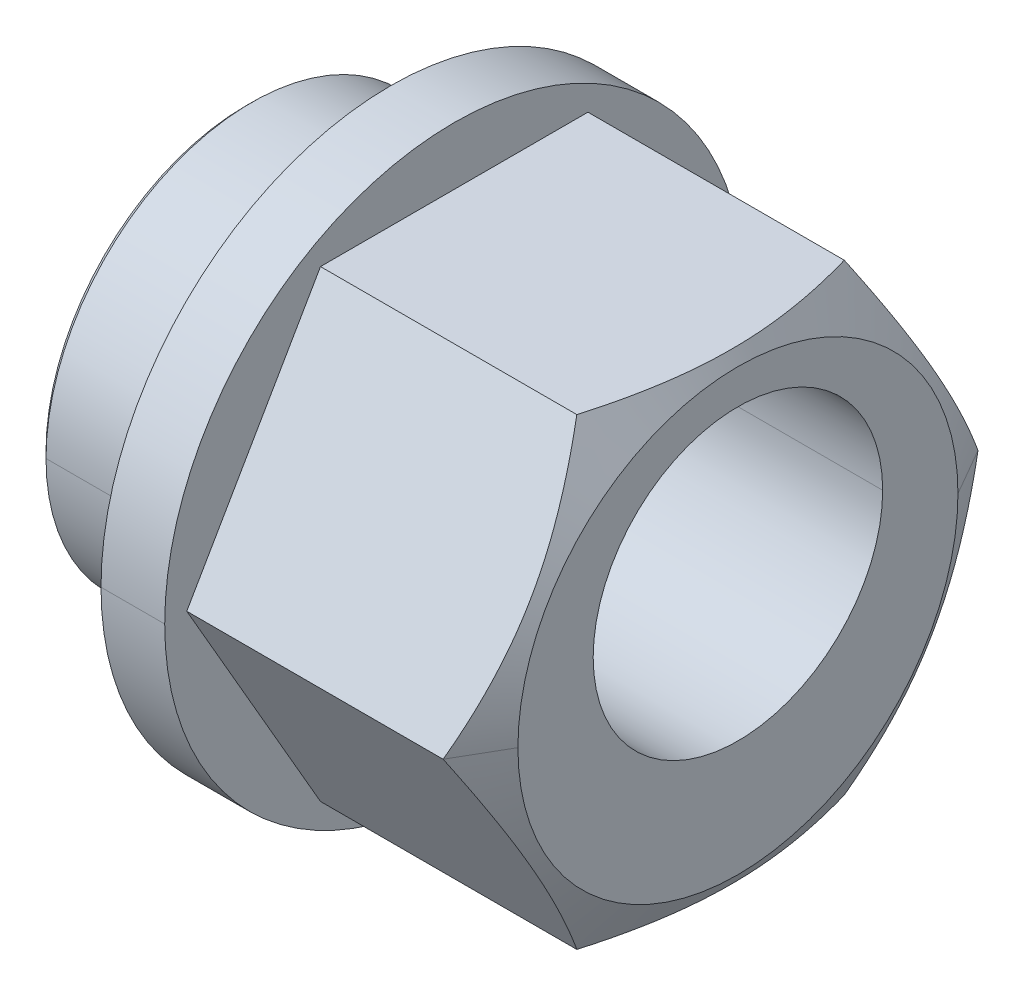
ISO-10303-21;
HEADER;
FILE_DESCRIPTION(('STEP AP214'),'2;1');
FILE_NAME('part.step','',(''),(''),'','','');
FILE_SCHEMA(('AUTOMOTIVE_DESIGN { 1 0 10303 214 1 1 1 1 }'));
ENDSEC;
DATA;
#1=APPLICATION_CONTEXT('core data for automotive mechanical design processes');
#2=APPLICATION_PROTOCOL_DEFINITION('international standard','automotive_design',2000,#1);
#3=PRODUCT_CONTEXT('',#1,'mechanical');
#4=PRODUCT('Part','Part','',(#3));
#5=PRODUCT_RELATED_PRODUCT_CATEGORY('part','',(#4));
#6=PRODUCT_DEFINITION_FORMATION('','',#4);
#7=PRODUCT_DEFINITION_CONTEXT('part definition',#1,'design');
#8=PRODUCT_DEFINITION('design','',#6,#7);
#9=PRODUCT_DEFINITION_SHAPE('','',#8);
#10=(LENGTH_UNIT() NAMED_UNIT(*) SI_UNIT(.MILLI.,.METRE.));
#11=(NAMED_UNIT(*) PLANE_ANGLE_UNIT() SI_UNIT($,.RADIAN.));
#12=(NAMED_UNIT(*) SI_UNIT($,.STERADIAN.) SOLID_ANGLE_UNIT());
#13=UNCERTAINTY_MEASURE_WITH_UNIT(LENGTH_MEASURE(1.E-05),#10,'distance_accuracy_value','');
#14=(GEOMETRIC_REPRESENTATION_CONTEXT(3) GLOBAL_UNCERTAINTY_ASSIGNED_CONTEXT((#13)) GLOBAL_UNIT_ASSIGNED_CONTEXT((#10,
#11,#12)) REPRESENTATION_CONTEXT('',''));
#15=CARTESIAN_POINT('',(0.,0.,0.));
#16=DIRECTION('',(0.,0.,1.));
#17=DIRECTION('',(1.,0.,0.));
#18=AXIS2_PLACEMENT_3D('',#15,#16,#17);
#19=CARTESIAN_POINT('',(0.,0.,0.));
#20=DIRECTION('',(-1.,0.,0.));
#21=DIRECTION('',(0.,0.,1.));
#22=AXIS2_PLACEMENT_3D('',#19,#20,#21);
#23=CYLINDRICAL_SURFACE('',#22,5.);
#24=DIRECTION('',(-1.,0.,0.));
#25=VECTOR('',#24,1.);
#26=CARTESIAN_POINT('',(0.,0.,-5.));
#27=LINE('',#26,#25);
#28=CARTESIAN_POINT('',(-0.65,0.,-5.));
#29=VERTEX_POINT('',#28);
#30=CARTESIAN_POINT('',(-1.75,0.,-5.));
#31=VERTEX_POINT('',#30);
#32=EDGE_CURVE('E441',#29,#31,#27,.T.);
#33=ORIENTED_EDGE('',*,*,#32,.F.);
#34=CARTESIAN_POINT('',(-0.65,0.,0.));
#35=DIRECTION('',(1.,0.,0.));
#36=DIRECTION('',(0.,0.,1.));
#37=AXIS2_PLACEMENT_3D('',#34,#35,#36);
#38=CIRCLE('',#37,5.);
#39=CARTESIAN_POINT('',(-0.65,0.,5.));
#40=VERTEX_POINT('',#39);
#41=EDGE_CURVE('E11',#40,#29,#38,.T.);
#42=ORIENTED_EDGE('',*,*,#41,.F.);
#43=DIRECTION('',(-1.,0.,0.));
#44=VECTOR('',#43,1.);
#45=CARTESIAN_POINT('',(0.,0.,5.));
#46=LINE('',#45,#44);
#47=CARTESIAN_POINT('',(-1.75,0.,5.));
#48=VERTEX_POINT('',#47);
#49=EDGE_CURVE('E417',#40,#48,#46,.T.);
#50=ORIENTED_EDGE('',*,*,#49,.T.);
#51=CARTESIAN_POINT('',(-1.75,0.,0.));
#52=DIRECTION('',(1.,0.,0.));
#53=DIRECTION('',(0.,0.,1.));
#54=AXIS2_PLACEMENT_3D('',#51,#52,#53);
#55=CIRCLE('',#54,5.);
#56=EDGE_CURVE('E30',#48,#31,#55,.T.);
#57=ORIENTED_EDGE('',*,*,#56,.T.);
#58=EDGE_LOOP('',(#33,#42,#50,#57));
#59=FACE_BOUND('',#58,.T.);
#60=ADVANCED_FACE('F17',(#59),#23,.T.);
#61=CARTESIAN_POINT('',(-0.65,5.,0.));
#62=DIRECTION('',(1.,0.,0.));
#63=DIRECTION('',(0.,1.,0.));
#64=AXIS2_PLACEMENT_3D('',#61,#62,#63);
#65=PLANE('',#64);
#66=DIRECTION('',(0.,0.866025403784439,-0.5));
#67=VECTOR('',#66,1.);
#68=CARTESIAN_POINT('',(-0.65,-4.,-2.30940107675851));
#69=LINE('',#68,#67);
#70=CARTESIAN_POINT('',(-0.65,-4.,-2.30940107675851));
#71=VERTEX_POINT('',#70);
#72=CARTESIAN_POINT('',(-0.65,3.4530903348682E-12,-4.61880215351501));
#73=VERTEX_POINT('',#72);
#74=EDGE_CURVE('E44',#71,#73,#69,.T.);
#75=ORIENTED_EDGE('',*,*,#74,.F.);
#76=DIRECTION('',(0.,0.,-1.));
#77=VECTOR('',#76,1.);
#78=CARTESIAN_POINT('',(-0.65,-4.,2.30940107675851));
#79=LINE('',#78,#77);
#80=CARTESIAN_POINT('',(-0.65,-3.99999999687367,2.3094010930034));
#81=VERTEX_POINT('',#80);
#82=EDGE_CURVE('E154',#81,#71,#79,.T.);
#83=ORIENTED_EDGE('',*,*,#82,.F.);
#84=DIRECTION('',(0.,-0.866025403784439,-0.5));
#85=VECTOR('',#84,1.);
#86=CARTESIAN_POINT('',(-0.65,0.,4.61880215351701));
#87=LINE('',#86,#85);
#88=CARTESIAN_POINT('',(-0.65,1.48208150438996E-11,4.61880215352214));
#89=VERTEX_POINT('',#88);
#90=EDGE_CURVE('E151',#89,#81,#87,.T.);
#91=ORIENTED_EDGE('',*,*,#90,.F.);
#92=DIRECTION('',(0.,-0.866025403784439,0.5));
#93=VECTOR('',#92,1.);
#94=CARTESIAN_POINT('',(-0.65,4.,2.30940107675851));
#95=LINE('',#94,#93);
#96=CARTESIAN_POINT('',(-0.65,4.00000001250421,2.30940106592954));
#97=VERTEX_POINT('',#96);
#98=EDGE_CURVE('E137',#97,#89,#95,.T.);
#99=ORIENTED_EDGE('',*,*,#98,.F.);
#100=DIRECTION('',(0.,0.,1.));
#101=VECTOR('',#100,1.);
#102=CARTESIAN_POINT('',(-0.65,4.,-2.3094010767585));
#103=LINE('',#102,#101);
#104=CARTESIAN_POINT('',(-0.65,3.99999999687402,-2.30940109300157));
#105=VERTEX_POINT('',#104);
#106=EDGE_CURVE('E449',#105,#97,#103,.T.);
#107=ORIENTED_EDGE('',*,*,#106,.F.);
#108=DIRECTION('',(0.,0.866025403784439,0.5));
#109=VECTOR('',#108,1.);
#110=CARTESIAN_POINT('',(-0.65,0.,-4.61880215351701));
#111=LINE('',#110,#109);
#112=EDGE_CURVE('E626',#73,#105,#111,.T.);
#113=ORIENTED_EDGE('',*,*,#112,.F.);
#114=EDGE_LOOP('',(#75,#83,#91,#99,#107,#113));
#115=FACE_BOUND('',#114,.T.);
#116=ORIENTED_EDGE('',*,*,#41,.T.);
#117=CARTESIAN_POINT('',(-0.65,0.,0.));
#118=DIRECTION('',(1.,0.,0.));
#119=DIRECTION('',(0.,0.,1.));
#120=AXIS2_PLACEMENT_3D('',#117,#118,#119);
#121=CIRCLE('',#120,5.);
#122=EDGE_CURVE('E457',#29,#40,#121,.T.);
#123=ORIENTED_EDGE('',*,*,#122,.T.);
#124=EDGE_LOOP('',(#116,#123));
#125=FACE_BOUND('',#124,.T.);
#126=ADVANCED_FACE('F19',(#115,#125),#65,.T.);
#127=CARTESIAN_POINT('',(-1.75,5.,0.));
#128=DIRECTION('',(1.,0.,0.));
#129=DIRECTION('',(0.,1.,0.));
#130=AXIS2_PLACEMENT_3D('',#127,#128,#129);
#131=PLANE('',#130);
#132=CARTESIAN_POINT('',(-1.75,0.,0.));
#133=DIRECTION('',(-1.,0.,0.));
#134=DIRECTION('',(0.,0.,1.));
#135=AXIS2_PLACEMENT_3D('',#132,#133,#134);
#136=CIRCLE('',#135,3.55);
#137=CARTESIAN_POINT('',(-1.75,0.,3.55));
#138=VERTEX_POINT('',#137);
#139=CARTESIAN_POINT('',(-1.75,0.,-3.55));
#140=VERTEX_POINT('',#139);
#141=EDGE_CURVE('E182',#138,#140,#136,.T.);
#142=ORIENTED_EDGE('',*,*,#141,.F.);
#143=CARTESIAN_POINT('',(-1.75,0.,0.));
#144=DIRECTION('',(-1.,0.,0.));
#145=DIRECTION('',(0.,0.,1.));
#146=AXIS2_PLACEMENT_3D('',#143,#144,#145);
#147=CIRCLE('',#146,3.55);
#148=EDGE_CURVE('E356',#140,#138,#147,.T.);
#149=ORIENTED_EDGE('',*,*,#148,.F.);
#150=EDGE_LOOP('',(#142,#149));
#151=FACE_BOUND('',#150,.T.);
#152=ORIENTED_EDGE('',*,*,#56,.F.);
#153=CARTESIAN_POINT('',(-1.75,0.,0.));
#154=DIRECTION('',(1.,0.,0.));
#155=DIRECTION('',(0.,0.,1.));
#156=AXIS2_PLACEMENT_3D('',#153,#154,#155);
#157=CIRCLE('',#156,5.);
#158=EDGE_CURVE('E432',#31,#48,#157,.T.);
#159=ORIENTED_EDGE('',*,*,#158,.F.);
#160=EDGE_LOOP('',(#152,#159));
#161=FACE_BOUND('',#160,.T.);
#162=ADVANCED_FACE('F857',(#151,#161),#131,.F.);
#163=CARTESIAN_POINT('',(-16.0335569799682,-4.,-2.30940107675851));
#164=DIRECTION('',(0.,-0.5,-0.866025403784439));
#165=DIRECTION('',(0.,-0.866025403784439,0.5));
#166=AXIS2_PLACEMENT_3D('',#163,#164,#165);
#167=PLANE('',#166);
#168=CARTESIAN_POINT('',(3.77726437412585,-4.,-2.30940101478377));
#169=CARTESIAN_POINT('',(3.80519870993255,-3.9161956272692,-2.35777895486919));
#170=CARTESIAN_POINT('',(3.83192511441484,-3.83208031891841,-2.4063355972529));
#171=CARTESIAN_POINT('',(3.88200284529315,-3.66531270844499,-2.50262393731974));
#172=CARTESIAN_POINT('',(3.90542092931195,-3.58267519575891,-2.5503466164956));
#173=CARTESIAN_POINT('',(3.94889246948545,-3.41846644993615,-2.6452144453723));
#174=CARTESIAN_POINT('',(3.96900317253339,-3.33690632860232,-2.69235242391481));
#175=CARTESIAN_POINT('',(4.00585775589339,-3.17439569050828,-2.78630503323489));
#176=CARTESIAN_POINT('',(4.02264419975537,-3.09345225345188,-2.83311517311735));
#177=CARTESIAN_POINT('',(4.05369004298886,-2.9274371069949,-2.92894233584061));
#178=CARTESIAN_POINT('',(4.06780442846447,-2.84234145882126,-2.97796519986655));
#179=CARTESIAN_POINT('',(4.09195134676672,-2.67334804024088,-3.07530990605876));
#180=CARTESIAN_POINT('',(4.10205627283969,-2.58945819144323,-3.12362739221196));
#181=CARTESIAN_POINT('',(4.11820481999194,-2.42214689849685,-3.22013419429681));
#182=CARTESIAN_POINT('',(4.1242815167232,-2.33872736072518,-3.26832123454136));
#183=CARTESIAN_POINT('',(4.13241719152581,-2.1714958813286,-3.36499678783931));
#184=CARTESIAN_POINT('',(4.13446270504651,-2.08768355876174,-3.41348577036787));
#185=CARTESIAN_POINT('',(4.13459480422926,-1.91941513164432,-3.51061897499976));
#186=CARTESIAN_POINT('',(4.13265544463653,-1.83495839773552,-3.55926214245593));
#187=CARTESIAN_POINT('',(4.1246943056867,-1.66657827538702,-3.65628866544214));
#188=CARTESIAN_POINT('',(4.11869036245238,-1.58265416704515,-3.70467222906877));
#189=CARTESIAN_POINT('',(4.10264374793344,-1.4145330496652,-3.80174624105042));
#190=CARTESIAN_POINT('',(4.09257129112916,-1.33033867300252,-3.85043628711587));
#191=CARTESIAN_POINT('',(4.0684480518484,-1.16080155347877,-3.94849629272073));
#192=CARTESIAN_POINT('',(4.05432689257414,-1.07546650449104,-3.99786209627561));
#193=CARTESIAN_POINT('',(4.0232588570068,-0.909036172948516,-4.09398819739629));
#194=CARTESIAN_POINT('',(4.00646670334998,-0.827922044044928,-4.14076623621978));
#195=CARTESIAN_POINT('',(3.96957240607652,-0.665043418587901,-4.23473790022201));
#196=CARTESIAN_POINT('',(3.94942531823478,-0.583286837926325,-4.28192755483478));
#197=CARTESIAN_POINT('',(3.90585218775637,-0.418652936324035,-4.37698932609435));
#198=CARTESIAN_POINT('',(3.8823664561961,-0.335787865594583,-4.42485511485887));
#199=CARTESIAN_POINT('',(3.83212430476964,-0.16850389833451,-4.521485229851));
#200=CARTESIAN_POINT('',(3.8052987866747,-0.0841005341154185,-4.57024060985095));
#201=CARTESIAN_POINT('',(3.77726436873621,-3.74976157548811E-08,-4.61880213186476));
#202=B_SPLINE_CURVE_WITH_KNOTS('',3,(#168,#169,#170,#171,#172,#173,#174,#175,#176,#177,#178,
#179,#180,#181,#182,#183,#184,#185,#186,#187,#188,#189,#190,#191,#192,#193,#194,#195,#196,#197,
#198,#199,#200,#201),.UNSPECIFIED.,.F.,.F.,(4,2,2,2,2,2,2,2,2,2,2,2,2,2,2,2,4),(0.,
0.30215722779744,0.596895393122196,0.885820933170358,1.17076636107292,1.46834357250639,
1.76027241140297,2.04977352099937,2.34023996502845,2.63260360921043,2.9236925545966,
3.21695234078176,3.51565574203644,3.8009926557766,4.09051551200188,4.38608455116355,
4.68932925761285),.UNSPECIFIED.);
#203=CARTESIAN_POINT('',(3.77726437412585,-4.,-2.30940101478376));
#204=VERTEX_POINT('',#203);
#205=CARTESIAN_POINT('',(3.77726436873622,-3.74976083109087E-08,-4.61880213186476));
#206=VERTEX_POINT('',#205);
#207=EDGE_CURVE('E351',#204,#206,#202,.T.);
#208=ORIENTED_EDGE('',*,*,#207,.F.);
#209=DIRECTION('',(1.,0.,0.));
#210=VECTOR('',#209,1.);
#211=CARTESIAN_POINT('',(-16.0335569799682,-4.,-2.30940107675851));
#212=LINE('',#211,#210);
#213=EDGE_CURVE('E165',#71,#204,#212,.T.);
#214=ORIENTED_EDGE('',*,*,#213,.F.);
#215=ORIENTED_EDGE('',*,*,#74,.T.);
#216=DIRECTION('',(-1.,0.,0.));
#217=VECTOR('',#216,1.);
#218=CARTESIAN_POINT('',(-16.0335569799682,5.18045986577504E-12,-4.61880215351402));
#219=LINE('',#218,#217);
#220=EDGE_CURVE('E557',#206,#73,#219,.T.);
#221=ORIENTED_EDGE('',*,*,#220,.F.);
#222=EDGE_LOOP('',(#208,#214,#215,#221));
#223=FACE_BOUND('',#222,.T.);
#224=ADVANCED_FACE('F853',(#223),#167,.T.);
#225=CARTESIAN_POINT('',(-16.0335569799682,0.,-4.61880215351701));
#226=DIRECTION('',(0.,0.5,-0.866025403784439));
#227=DIRECTION('',(-1.,0.,0.));
#228=AXIS2_PLACEMENT_3D('',#225,#226,#227);
#229=PLANE('',#228);
#230=CARTESIAN_POINT('',(3.77726436873621,-3.74976157548811E-08,-4.61880213186476));
#231=CARTESIAN_POINT('',(3.80519870427004,0.0837986770710126,-4.570414386344));
#232=CARTESIAN_POINT('',(3.83192510875601,0.167907619708529,-4.52184671319164));
#233=CARTESIAN_POINT('',(3.88200283957895,0.334679576473049,-4.42556589505043));
#234=CARTESIAN_POINT('',(3.90542092357863,0.41732738563103,-4.3778610488656));
#235=CARTESIAN_POINT('',(3.94889246365869,0.581589706863113,-4.28308601725495));
#236=CARTESIAN_POINT('',(3.96900316668174,0.663192452627941,-4.23602186937211));
#237=CARTESIAN_POINT('',(4.00585774990265,0.825813112626669,-4.14225983349461));
#238=CARTESIAN_POINT('',(4.02264419370988,0.906823597771041,-4.09556583126504));
#239=CARTESIAN_POINT('',(4.05369003784685,1.07281992452056,-3.99970607738232));
#240=CARTESIAN_POINT('',(4.06780442413837,1.15782279414343,-3.95052251471618));
#241=CARTESIAN_POINT('',(4.09195134383189,1.32662249075005,-3.85284227173569));
#242=CARTESIAN_POINT('',(4.10205627052969,1.41041158450485,-3.80435027373176));
#243=CARTESIAN_POINT('',(4.11820481869012,1.57764457018939,-3.70770784382329));
#244=CARTESIAN_POINT('',(4.12428151585525,1.6610855381217,-3.65955792504466));
#245=CARTESIAN_POINT('',(4.13241719120132,1.8284247584384,-3.56306899336505));
#246=CARTESIAN_POINT('',(4.13446270487759,1.91232360787039,-3.51472988529864));
#247=CARTESIAN_POINT('',(4.13459480438928,2.08057764118649,-3.41757175665304));
#248=CARTESIAN_POINT('',(4.13265544488107,2.16493222639768,-3.36875166370849));
#249=CARTESIAN_POINT('',(4.12469430625737,2.33314972009229,-3.27144346253537));
#250=CARTESIAN_POINT('',(4.1186903632732,2.41701316874435,-3.22295483490195));
#251=CARTESIAN_POINT('',(4.10264374932304,2.5851422861709,-3.12589468320208));
#252=CARTESIAN_POINT('',(4.09257129284802,2.66940629036545,-3.0773252376942));
#253=CARTESIAN_POINT('',(4.06844805430022,2.83909730398972,-2.9795317893059));
#254=CARTESIAN_POINT('',(4.0543268954408,2.92451686729649,-2.9303123715232));
#255=CARTESIAN_POINT('',(4.02325886017249,3.09097967952772,-2.83424252655659));
#256=CARTESIAN_POINT('',(4.00646670627213,3.17204771598543,-2.78738464859081));
#257=CARTESIAN_POINT('',(3.9695724085397,3.33486887980892,-2.69331345190966));
#258=CARTESIAN_POINT('',(3.94942532053018,3.41661461062722,-2.64610500327227));
#259=CARTESIAN_POINT('',(3.90585218973204,3.5812574707645,-2.5510587487727));
#260=CARTESIAN_POINT('',(3.88236645806016,3.66414299488486,-2.50322838796898));
#261=CARTESIAN_POINT('',(3.83212430644688,3.83146911134492,-2.40667128407771));
#262=CARTESIAN_POINT('',(3.80529878830996,3.9158941898871,-2.35795351926857));
#263=CARTESIAN_POINT('',(3.7772643701304,3.99999994893671,-2.30940111706862));
#264=B_SPLINE_CURVE_WITH_KNOTS('',3,(#230,#231,#232,#233,#234,#235,#236,#237,#238,#239,#240,
#241,#242,#243,#244,#245,#246,#247,#248,#249,#250,#251,#252,#253,#254,#255,#256,#257,#258,#259,
#260,#261,#262,#263),.UNSPECIFIED.,.F.,.F.,(4,2,2,2,2,2,2,2,2,2,2,2,2,2,2,2,4),(0.,
0.302157235086627,0.596895401900173,0.885820937572439,1.17076635518052,1.46834356915714,
1.7602724067554,2.04977351142435,2.34023994715307,2.63260358946254,2.92369253232563,
3.21695231522368,3.51565571232867,3.80099263310754,4.09051549169599,4.38608452852623,
4.68932922794447),.UNSPECIFIED.);
#265=CARTESIAN_POINT('',(3.7772643701304,3.99999994893671,-2.30940111706861));
#266=VERTEX_POINT('',#265);
#267=EDGE_CURVE('E503',#206,#266,#264,.T.);
#268=ORIENTED_EDGE('',*,*,#267,.F.);
#269=ORIENTED_EDGE('',*,*,#220,.T.);
#270=ORIENTED_EDGE('',*,*,#112,.T.);
#271=DIRECTION('',(-1.,0.,0.));
#272=VECTOR('',#271,1.);
#273=CARTESIAN_POINT('',(-16.0335569799682,4.,-2.30940109841592));
#274=LINE('',#273,#272);
#275=EDGE_CURVE('E148',#266,#105,#274,.T.);
#276=ORIENTED_EDGE('',*,*,#275,.F.);
#277=EDGE_LOOP('',(#268,#269,#270,#276));
#278=FACE_BOUND('',#277,.T.);
#279=ADVANCED_FACE('F245',(#278),#229,.T.);
#280=CARTESIAN_POINT('',(-16.0335569799682,4.,-2.3094010767585));
#281=DIRECTION('',(0.,1.,0.));
#282=DIRECTION('',(1.,0.,0.));
#283=AXIS2_PLACEMENT_3D('',#280,#281,#282);
#284=PLANE('',#283);
#285=CARTESIAN_POINT('',(3.7772643701304,3.99999994893671,-2.30940111706862));
#286=CARTESIAN_POINT('',(3.80523174876833,3.999994265142,-2.21252094007954));
#287=CARTESIAN_POINT('',(3.83198869861946,3.99998716216124,-2.11528135697864));
#288=CARTESIAN_POINT('',(3.8821187088704,3.99998945302128,-1.92248900496844));
#289=CARTESIAN_POINT('',(3.9055588541629,3.99999844507742,-1.82695363608258));
#290=CARTESIAN_POINT('',(3.94906577698378,4.00004960883251,-1.63710048028363));
#291=CARTESIAN_POINT('',(3.96919008648806,4.00009112102596,-1.5427959642943));
#292=CARTESIAN_POINT('',(4.00606305626099,4.00019987374281,-1.35487970628664));
#293=CARTESIAN_POINT('',(4.02285448820307,4.00026675111729,-1.2612763770173));
#294=CARTESIAN_POINT('',(4.05392763429453,4.00024775963525,-1.06922892039436));
#295=CARTESIAN_POINT('',(4.06805836134919,4.00015472257093,-0.970760189721849));
#296=CARTESIAN_POINT('',(4.09221523439663,3.99996072475806,-0.775216315586452));
#297=CARTESIAN_POINT('',(4.10231428740102,3.99985994821386,-0.678150255112348));
#298=CARTESIAN_POINT('',(4.11842751187931,3.99978461344259,-0.484485434459958));
#299=CARTESIAN_POINT('',(4.12447478485132,3.99980901795716,-0.387889451310588));
#300=CARTESIAN_POINT('',(4.13253266200258,3.99991719862141,-0.194196040287088));
#301=CARTESIAN_POINT('',(4.13452926610598,4.00000117933584,-0.0970980322267478));
#302=CARTESIAN_POINT('',(4.13453062605965,3.99999882091373,0.0970774838292789));
#303=CARTESIAN_POINT('',(4.13253622659648,3.99991251781741,0.194154991814738));
#304=CARTESIAN_POINT('',(4.12448125340017,3.99980425661511,0.387820787748987));
#305=CARTESIAN_POINT('',(4.11843412505663,3.99978208702771,0.484409632753016));
#306=CARTESIAN_POINT('',(4.10232064807888,3.99986186747581,0.67807399336406));
#307=CARTESIAN_POINT('',(4.0922206293603,3.99996487233756,0.77514668373971));
#308=CARTESIAN_POINT('',(4.06806183038743,4.00015921954309,0.970718219424864));
#309=CARTESIAN_POINT('',(4.05392962735209,4.00025029500337,1.06920791817212));
#310=CARTESIAN_POINT('',(4.02285743441509,4.00026435234174,1.26126637405288));
#311=CARTESIAN_POINT('',(4.00606949852653,4.00019459945869,1.35485990498826));
#312=CARTESIAN_POINT('',(3.96920100943377,4.00008363909564,1.54276266635843));
#313=CARTESIAN_POINT('',(3.94907745351471,4.0000428470474,1.63706343912363));
#314=CARTESIAN_POINT('',(3.90557037391075,3.99999376936691,1.82691598212274));
#315=CARTESIAN_POINT('',(3.88212910236332,3.99998615851335,1.92245443114399));
#316=CARTESIAN_POINT('',(3.83199496036977,3.99998619642307,2.11526035130422));
#317=CARTESIAN_POINT('',(3.80523479938716,3.99999423635059,2.21251036895769));
#318=CARTESIAN_POINT('',(3.77726437013586,4.00000000937816,2.30940101236204));
#319=B_SPLINE_CURVE_WITH_KNOTS('',3,(#285,#286,#287,#288,#289,#290,#291,#292,#293,#294,#295,
#296,#297,#298,#299,#300,#301,#302,#303,#304,#305,#306,#307,#308,#309,#310,#311,#312,#313,#314,
#315,#316,#317,#318),.UNSPECIFIED.,.F.,.F.,(4,2,2,2,2,2,2,2,2,2,2,2,2,2,2,2,4),(0.,
0.30251477468299,0.597582790683914,0.886817053430785,1.17205781287051,1.47042030897987,
1.7631121476674,2.05338266048535,2.34465471979871,2.63586513858329,2.92611418495783,
3.21882616972369,3.51725157791909,3.80246153720305,4.09168430062213,4.38676210166173,
4.68930960160094),.UNSPECIFIED.);
#320=CARTESIAN_POINT('',(3.77726437013586,4.00000000937816,2.30940101236204));
#321=VERTEX_POINT('',#320);
#322=EDGE_CURVE('E229',#266,#321,#319,.T.);
#323=ORIENTED_EDGE('',*,*,#322,.F.);
#324=ORIENTED_EDGE('',*,*,#275,.T.);
#325=ORIENTED_EDGE('',*,*,#106,.T.);
#326=DIRECTION('',(-1.,0.,0.));
#327=VECTOR('',#326,1.);
#328=CARTESIAN_POINT('',(-16.0335569799682,4.00000001875631,2.30940106592954));
#329=LINE('',#328,#327);
#330=EDGE_CURVE('E144',#321,#97,#329,.T.);
#331=ORIENTED_EDGE('',*,*,#330,.F.);
#332=EDGE_LOOP('',(#323,#324,#325,#331));
#333=FACE_BOUND('',#332,.T.);
#334=ADVANCED_FACE('F236',(#333),#284,.T.);
#335=CARTESIAN_POINT('',(-16.0335569799682,4.,2.30940107675851));
#336=DIRECTION('',(0.,0.5,0.866025403784439));
#337=DIRECTION('',(1.,0.,0.));
#338=AXIS2_PLACEMENT_3D('',#335,#336,#337);
#339=PLANE('',#338);
#340=CARTESIAN_POINT('',(3.77726437013586,4.00000000937816,2.30940101236204));
#341=CARTESIAN_POINT('',(3.80519870661105,3.91619563475929,2.35777895364495));
#342=CARTESIAN_POINT('',(3.83192511174989,3.83208032447365,2.40633559715491));
#343=CARTESIAN_POINT('',(3.88200284378814,3.66531271034951,2.50262393920979));
#344=CARTESIAN_POINT('',(3.90542092831969,3.58267519595115,2.55034661924873));
#345=CARTESIAN_POINT('',(3.94889246936714,3.41846644692311,2.64521444964815));
#346=CARTESIAN_POINT('',(3.96900317278605,3.33690632409889,2.69235242885025));
#347=CARTESIAN_POINT('',(4.00585775673304,3.17439568324004,2.78630503935136));
#348=CARTESIAN_POINT('',(4.02264420082068,3.09345224491091,2.83311517975444));
#349=CARTESIAN_POINT('',(4.05369004439621,2.92743709589555,2.92894234353181));
#350=CARTESIAN_POINT('',(4.06780442998544,2.84234144643624,2.97796520809203));
#351=CARTESIAN_POINT('',(4.09195134836718,2.67334802540483,3.07530991532261));
#352=CARTESIAN_POINT('',(4.10205627441256,2.58945817544214,3.12362740197904));
#353=CARTESIAN_POINT('',(4.11820482136366,2.42214688025209,3.22013420508444));
#354=CARTESIAN_POINT('',(4.12428151792506,2.33872734140172,3.26832124584572));
#355=CARTESIAN_POINT('',(4.13241719223791,2.17149585989893,3.36499680023563));
#356=CARTESIAN_POINT('',(4.13446270543876,2.08768353630472,3.4134857833396));
#357=CARTESIAN_POINT('',(4.13459480386927,1.91941510693219,3.51061898926109));
#358=CARTESIAN_POINT('',(4.1326554438331,1.83495837179552,3.55926215743109));
#359=CARTESIAN_POINT('',(4.12469430389285,1.66657824700629,3.65628868182789));
#360=CARTESIAN_POINT('',(4.1186903601117,1.5826541374515,3.70467224615137));
#361=CARTESIAN_POINT('',(4.1026437444065,1.41453301762442,3.80174625952063));
#362=CARTESIAN_POINT('',(4.09257128696089,1.33033863972776,3.85043630627662));
#363=CARTESIAN_POINT('',(4.06844804624753,1.16080151775292,3.94849631336313));
#364=CARTESIAN_POINT('',(4.05432688617766,1.07546646754979,3.99786211771017));
#365=CARTESIAN_POINT('',(4.02325884909576,0.909036133074315,4.09398822031602));
#366=CARTESIAN_POINT('',(4.00646669469935,0.827922002462458,4.14076625984368));
#367=CARTESIAN_POINT('',(3.96957239634825,0.665043374562993,4.23473792419271));
#368=CARTESIAN_POINT('',(3.94942530821735,0.58328679315562,4.28192757844691));
#369=CARTESIAN_POINT('',(3.90585217750048,0.418652891359152,4.37698934821412));
#370=CARTESIAN_POINT('',(3.88236644603748,0.335787821171724,4.4248551358496));
#371=CARTESIAN_POINT('',(3.83212429516896,0.168503856530037,4.52148524799893));
#372=CARTESIAN_POINT('',(3.80529877757796,0.0841004943813566,4.57024062629691));
#373=CARTESIAN_POINT('',(3.77726436007899,0.,4.6188021468595));
#374=B_SPLINE_CURVE_WITH_KNOTS('',3,(#340,#341,#342,#343,#344,#345,#346,#347,#348,#349,#350,
#351,#352,#353,#354,#355,#356,#357,#358,#359,#360,#361,#362,#363,#364,#365,#366,#367,#368,#369,
#370,#371,#372,#373),.UNSPECIFIED.,.F.,.F.,(4,2,2,2,2,2,2,2,2,2,2,2,2,2,2,2,4),(0.,
0.302157234793956,0.596895406062404,0.885820951095213,1.17076638313781,1.46834359871611,
1.76027244136159,2.04977355449117,2.34024000202698,2.63260365049164,2.92369260016563,
3.21695239076379,3.51565579665875,3.80099271620534,4.09051557398567,4.38608461006337,
4.6893293084661),.UNSPECIFIED.);
#375=CARTESIAN_POINT('',(3.777264360079,1.15489183510618E-08,4.61880214685951));
#376=VERTEX_POINT('',#375);
#377=EDGE_CURVE('E183',#321,#376,#374,.T.);
#378=ORIENTED_EDGE('',*,*,#377,.F.);
#379=ORIENTED_EDGE('',*,*,#330,.T.);
#380=ORIENTED_EDGE('',*,*,#98,.T.);
#381=DIRECTION('',(-1.,0.,0.));
#382=VECTOR('',#381,1.);
#383=CARTESIAN_POINT('',(-16.0335569799682,1.7785079165981E-11,4.61880215352728));
#384=LINE('',#383,#382);
#385=EDGE_CURVE('E142',#376,#89,#384,.T.);
#386=ORIENTED_EDGE('',*,*,#385,.F.);
#387=EDGE_LOOP('',(#378,#379,#380,#386));
#388=FACE_BOUND('',#387,.T.);
#389=ADVANCED_FACE('F140',(#388),#339,.T.);
#390=CARTESIAN_POINT('',(-16.0335569799682,0.,4.61880215351701));
#391=DIRECTION('',(0.,-0.5,0.866025403784439));
#392=DIRECTION('',(-1.,0.,0.));
#393=AXIS2_PLACEMENT_3D('',#390,#391,#392);
#394=PLANE('',#393);
#395=CARTESIAN_POINT('',(3.77726436007899,0.,4.6188021468595));
#396=CARTESIAN_POINT('',(3.80519869764892,-0.0837987149144486,4.57041439712618));
#397=CARTESIAN_POINT('',(3.83192510410496,-0.167907657997511,4.52184671985167));
#398=CARTESIAN_POINT('',(3.88200283824213,-0.334679615000732,4.42556589446334));
#399=CARTESIAN_POINT('',(3.90542092362364,-0.41732742393703,4.37786104514898));
#400=CARTESIAN_POINT('',(3.948892465857,-0.581589744260504,4.28308600832914));
#401=CARTESIAN_POINT('',(3.96900316968881,-0.663192489324146,4.23602185836034));
#402=CARTESIAN_POINT('',(4.00585775386253,-0.825813147720956,4.14225981949157));
#403=CARTESIAN_POINT('',(4.02264419784864,-0.906823631952196,4.0955658163494));
#404=CARTESIAN_POINT('',(4.0536900417219,-1.07281995577997,3.99970606200476));
#405=CARTESIAN_POINT('',(4.06780442761449,-1.15782282340463,3.95052249982181));
#406=CARTESIAN_POINT('',(4.09195134657976,-1.32662251663832,3.85284225775789));
#407=CARTESIAN_POINT('',(4.10205627292783,-1.41041160901825,3.8043502601817));
#408=CARTESIAN_POINT('',(4.11820482040587,-1.57764459257213,3.70770783105102));
#409=CARTESIAN_POINT('',(4.12428151721533,-1.66108555974976,3.65955791262032));
#410=CARTESIAN_POINT('',(4.13241719188794,-1.82842477909558,3.56306898142287));
#411=CARTESIAN_POINT('',(4.1344627052217,-1.91232362831256,3.51472987349081));
#412=CARTESIAN_POINT('',(4.13459480407226,-2.08057766053651,3.41757174548695));
#413=CARTESIAN_POINT('',(4.13265544427626,-2.16493224487117,3.36875165305106));
#414=CARTESIAN_POINT('',(4.12469430516573,-2.33314973684899,3.27144345287683));
#415=CARTESIAN_POINT('',(4.11869036198028,-2.41701318466075,3.22295482573366));
#416=CARTESIAN_POINT('',(4.10264374771726,-2.58514230040857,3.12589467500428));
#417=CARTESIAN_POINT('',(4.09257129113068,-2.6694063037646,3.07732522997662));
#418=CARTESIAN_POINT('',(4.06844805244595,-2.83909731568764,2.97953178256052));
#419=CARTESIAN_POINT('',(4.05432689356326,-2.92451687813179,2.93031236526969));
#420=CARTESIAN_POINT('',(4.02325885832699,-3.09097968868472,2.83424252126763));
#421=CARTESIAN_POINT('',(4.00646670447856,-3.17204772432632,2.78738464377443));
#422=CARTESIAN_POINT('',(3.96957240691922,-3.33486888651692,2.69331344803844));
#423=CARTESIAN_POINT('',(3.94942531903179,-3.41661461651855,2.64610499987356));
#424=CARTESIAN_POINT('',(3.90585218854577,-3.58125747500539,2.5510587463275));
#425=CARTESIAN_POINT('',(3.88236645706561,-3.66414299829226,2.50322838600458));
#426=CARTESIAN_POINT('',(3.8321243059032,-3.83146911305468,2.4066712830924));
#427=CARTESIAN_POINT('',(3.80529878802755,-3.91589419073317,2.3579535187813));
#428=CARTESIAN_POINT('',(3.77726437013367,-3.99999994892584,2.30940111707611));
#429=B_SPLINE_CURVE_WITH_KNOTS('',3,(#395,#396,#397,#398,#399,#400,#401,#402,#403,#404,#405,
#406,#407,#408,#409,#410,#411,#412,#413,#414,#415,#416,#417,#418,#419,#420,#421,#422,#423,#424,
#425,#426,#427,#428),.UNSPECIFIED.,.F.,.F.,(4,2,2,2,2,2,2,2,2,2,2,2,2,2,2,2,4),(0.,
0.3021572437222,0.596895415516263,0.885820952957153,1.17076636965533,1.46834357760235,
1.76027241089939,2.04977351302068,2.34023994796779,2.63260358725783,2.92369252724812,
3.21695230730009,3.51565570146858,3.80099261943698,4.09051547518253,4.38608450907347,
4.68932920540155),.UNSPECIFIED.);
#430=CARTESIAN_POINT('',(3.77726437013367,-3.99999994892585,2.30940111707611));
#431=VERTEX_POINT('',#430);
#432=EDGE_CURVE('E161',#376,#431,#429,.T.);
#433=ORIENTED_EDGE('',*,*,#432,.F.);
#434=ORIENTED_EDGE('',*,*,#385,.T.);
#435=ORIENTED_EDGE('',*,*,#90,.T.);
#436=DIRECTION('',(-1.,0.,0.));
#437=VECTOR('',#436,1.);
#438=CARTESIAN_POINT('',(-16.0335569799682,-4.,2.30940109841836));
#439=LINE('',#438,#437);
#440=EDGE_CURVE('E297',#431,#81,#439,.T.);
#441=ORIENTED_EDGE('',*,*,#440,.F.);
#442=EDGE_LOOP('',(#433,#434,#435,#441));
#443=FACE_BOUND('',#442,.T.);
#444=ADVANCED_FACE('F159',(#443),#394,.T.);
#445=CARTESIAN_POINT('',(-16.0335569799682,-4.,2.30940107675851));
#446=DIRECTION('',(0.,-1.,0.));
#447=DIRECTION('',(0.,0.,-1.));
#448=AXIS2_PLACEMENT_3D('',#445,#446,#447);
#449=PLANE('',#448);
#450=CARTESIAN_POINT('',(3.77726437013367,-3.99999994892584,2.30940111707611));
#451=CARTESIAN_POINT('',(3.80523174876462,-3.99999426513188,2.21252094011053));
#452=CARTESIAN_POINT('',(3.83198869860778,-3.99998716215504,2.1152813570329));
#453=CARTESIAN_POINT('',(3.88211870884676,-3.99998945302585,1.92248900505316));
#454=CARTESIAN_POINT('',(3.90555885413485,-3.99999844508878,1.82695363617439));
#455=CARTESIAN_POINT('',(3.94906577695082,-4.00004960885723,1.63710048037442));
#456=CARTESIAN_POINT('',(3.96919008645414,-4.00009112105727,1.54279596437688));
#457=CARTESIAN_POINT('',(4.00606305622921,-4.00019987378378,1.35487970633865));
#458=CARTESIAN_POINT('',(4.02285448817391,-4.00026675116139,1.26127637704687));
#459=CARTESIAN_POINT('',(4.05392763427181,-4.00024775967991,1.06922892038133));
#460=CARTESIAN_POINT('',(4.06805836133048,-4.00015472261277,0.970760189688703));
#461=CARTESIAN_POINT('',(4.09221523438435,-3.99996072479152,0.775216315526261));
#462=CARTESIAN_POINT('',(4.10231428739165,-3.99985994824183,0.678150255045292));
#463=CARTESIAN_POINT('',(4.11842751187425,-3.99978461345948,0.484485434392064));
#464=CARTESIAN_POINT('',(4.12447478484819,-3.99980901796846,0.387889451248767));
#465=CARTESIAN_POINT('',(4.13253266200163,-3.99991719862439,0.194196040249866));
#466=CARTESIAN_POINT('',(4.1345292661058,-4.00000117933611,0.0970980322080745));
#467=CARTESIAN_POINT('',(4.13453062605982,-3.99999882091347,-0.0970774834107875));
#468=CARTESIAN_POINT('',(4.13253622661265,-3.99991251782003,-0.194154990977631));
#469=CARTESIAN_POINT('',(4.12448125349627,-3.99980425658735,-0.387820786251541));
#470=CARTESIAN_POINT('',(4.11843412520926,-3.99978208696692,-0.484409631013538));
#471=CARTESIAN_POINT('',(4.10232064839138,-3.99986186727472,-0.678073991303674));
#472=CARTESIAN_POINT('',(4.09222062977011,-3.99996487202879,-0.775146681599966));
#473=CARTESIAN_POINT('',(4.06806183103663,-4.00015921891024,-0.970718217276648));
#474=CARTESIAN_POINT('',(4.05392962813905,-4.00025029415204,-1.06920791609435));
#475=CARTESIAN_POINT('',(4.02285743554392,-4.0002643509296,-1.26126637203627));
#476=CARTESIAN_POINT('',(4.00606949986004,-4.00019459771029,-1.35485990296223));
#477=CARTESIAN_POINT('',(3.96920101121416,-4.00008363648984,-1.54276266456862));
#478=CARTESIAN_POINT('',(3.94907745553081,-4.00004284391797,-1.63706343757827));
#479=CARTESIAN_POINT('',(3.90557037643427,-3.99999376494616,-1.82691598131688));
#480=CARTESIAN_POINT('',(3.88212910515354,-3.99998615332025,-1.92245443083222));
#481=CARTESIAN_POINT('',(3.83199496372668,-3.99998618938131,-2.11526035222721));
#482=CARTESIAN_POINT('',(3.80523480304037,-3.99999422822536,-2.21251037062071));
#483=CARTESIAN_POINT('',(3.77726437412585,-4.,-2.30940101478377));
#484=B_SPLINE_CURVE_WITH_KNOTS('',3,(#450,#451,#452,#453,#454,#455,#456,#457,#458,#459,#460,
#461,#462,#463,#464,#465,#466,#467,#468,#469,#470,#471,#472,#473,#474,#475,#476,#477,#478,#479,
#480,#481,#482,#483),.UNSPECIFIED.,.F.,.F.,(4,2,2,2,2,2,2,2,2,2,2,2,2,2,2,2,4),(0.,
0.302514774609361,0.597582790586473,0.886817053356843,1.1720578128643,1.47042030903517,
1.76311214774412,2.05338266054428,2.34465471980182,2.63586513733126,2.92611418297253,
3.21882616747329,3.51725157582049,3.8024615349712,4.09168429896332,4.38676210125454,
4.68930960310065),.UNSPECIFIED.);
#485=EDGE_CURVE('E293',#431,#204,#484,.T.);
#486=ORIENTED_EDGE('',*,*,#485,.F.);
#487=ORIENTED_EDGE('',*,*,#440,.T.);
#488=ORIENTED_EDGE('',*,*,#82,.T.);
#489=ORIENTED_EDGE('',*,*,#213,.T.);
#490=EDGE_LOOP('',(#486,#487,#488,#489));
#491=FACE_BOUND('',#490,.T.);
#492=ADVANCED_FACE('F254',(#491),#449,.T.);
#493=CARTESIAN_POINT('',(0.,0.,0.));
#494=DIRECTION('',(-1.,0.,0.));
#495=DIRECTION('',(0.,0.,1.));
#496=AXIS2_PLACEMENT_3D('',#493,#494,#495);
#497=CYLINDRICAL_SURFACE('',#496,3.55);
#498=DIRECTION('',(-1.,0.,0.));
#499=VECTOR('',#498,1.);
#500=CARTESIAN_POINT('',(0.,0.,-3.55));
#501=LINE('',#500,#499);
#502=CARTESIAN_POINT('',(-4.14999999998145,0.,-3.55000000007522));
#503=VERTEX_POINT('',#502);
#504=EDGE_CURVE('E475',#140,#503,#501,.T.);
#505=ORIENTED_EDGE('',*,*,#504,.F.);
#506=ORIENTED_EDGE('',*,*,#148,.T.);
#507=DIRECTION('',(-1.,0.,0.));
#508=VECTOR('',#507,1.);
#509=CARTESIAN_POINT('',(0.,0.,3.55));
#510=LINE('',#509,#508);
#511=CARTESIAN_POINT('',(-4.14999999998145,0.,3.55000000007522));
#512=VERTEX_POINT('',#511);
#513=EDGE_CURVE('E466',#138,#512,#510,.T.);
#514=ORIENTED_EDGE('',*,*,#513,.T.);
#515=CARTESIAN_POINT('',(-4.14999999998145,0.,0.));
#516=DIRECTION('',(-1.,0.,0.));
#517=DIRECTION('',(0.,0.,-1.));
#518=AXIS2_PLACEMENT_3D('',#515,#516,#517);
#519=CIRCLE('',#518,3.55000000007522);
#520=EDGE_CURVE('E375',#503,#512,#519,.T.);
#521=ORIENTED_EDGE('',*,*,#520,.F.);
#522=EDGE_LOOP('',(#505,#506,#514,#521));
#523=FACE_BOUND('',#522,.T.);
#524=ADVANCED_FACE('F250',(#523),#497,.T.);
#525=CARTESIAN_POINT('',(3.77442794240324,0.,0.));
#526=DIRECTION('',(-1.,0.,0.));
#527=DIRECTION('',(0.,0.,1.));
#528=AXIS2_PLACEMENT_3D('',#525,#526,#527);
#529=CONICAL_SURFACE('',#528,4.62371496638525,1.04719755118287);
#530=DIRECTION('',(-0.500000000011885,0.,-0.866025403777577));
#531=VECTOR('',#530,1.);
#532=CARTESIAN_POINT('',(3.77442794240324,0.,-4.62371496638525));
#533=LINE('',#532,#531);
#534=CARTESIAN_POINT('',(4.24999999995635,0.,-3.8000000000693));
#535=VERTEX_POINT('',#534);
#536=EDGE_CURVE('E510',#535,#206,#533,.T.);
#537=ORIENTED_EDGE('',*,*,#536,.F.);
#538=CARTESIAN_POINT('',(4.24999999995635,0.,0.));
#539=DIRECTION('',(-1.,0.,0.));
#540=DIRECTION('',(0.,0.,1.));
#541=AXIS2_PLACEMENT_3D('',#538,#539,#540);
#542=CIRCLE('',#541,3.8000000000693);
#543=CARTESIAN_POINT('',(4.24999999995635,0.,3.8000000000693));
#544=VERTEX_POINT('',#543);
#545=EDGE_CURVE('E383',#535,#544,#542,.T.);
#546=ORIENTED_EDGE('',*,*,#545,.T.);
#547=DIRECTION('',(-0.500000000011885,0.,0.866025403777577));
#548=VECTOR('',#547,1.);
#549=CARTESIAN_POINT('',(3.77442794240324,0.,4.62371496638525));
#550=LINE('',#549,#548);
#551=EDGE_CURVE('E179',#544,#376,#550,.T.);
#552=ORIENTED_EDGE('',*,*,#551,.T.);
#553=ORIENTED_EDGE('',*,*,#432,.T.);
#554=ORIENTED_EDGE('',*,*,#485,.T.);
#555=ORIENTED_EDGE('',*,*,#207,.T.);
#556=EDGE_LOOP('',(#537,#546,#552,#553,#554,#555));
#557=FACE_BOUND('',#556,.T.);
#558=ADVANCED_FACE('F253',(#557),#529,.T.);
#559=CARTESIAN_POINT('',(-4.14999999998145,0.,0.));
#560=DIRECTION('',(1.,0.,0.));
#561=DIRECTION('',(0.,0.,-1.));
#562=AXIS2_PLACEMENT_3D('',#559,#560,#561);
#563=CONICAL_SURFACE('',#562,3.55000000007522,0.785398163113232);
#564=DIRECTION('',(0.707106781387519,0.,0.707106780985576));
#565=VECTOR('',#564,1.);
#566=CARTESIAN_POINT('',(-4.14999999998145,0.,3.55000000007522));
#567=LINE('',#566,#565);
#568=CARTESIAN_POINT('',(-4.25000000007003,0.,3.45000000004348));
#569=VERTEX_POINT('',#568);
#570=EDGE_CURVE('E531',#569,#512,#567,.T.);
#571=ORIENTED_EDGE('',*,*,#570,.F.);
#572=CARTESIAN_POINT('',(-4.25000000007003,0.,0.));
#573=DIRECTION('',(1.,0.,0.));
#574=DIRECTION('',(0.,0.,-1.));
#575=AXIS2_PLACEMENT_3D('',#572,#573,#574);
#576=CIRCLE('',#575,3.45000000004348);
#577=CARTESIAN_POINT('',(-4.25000000007003,0.,-3.45000000004348));
#578=VERTEX_POINT('',#577);
#579=EDGE_CURVE('E392',#569,#578,#576,.T.);
#580=ORIENTED_EDGE('',*,*,#579,.T.);
#581=DIRECTION('',(0.707106781387519,0.,-0.707106780985576));
#582=VECTOR('',#581,1.);
#583=CARTESIAN_POINT('',(-4.14999999998145,0.,-3.55000000007522));
#584=LINE('',#583,#582);
#585=EDGE_CURVE('E520',#578,#503,#584,.T.);
#586=ORIENTED_EDGE('',*,*,#585,.T.);
#587=ORIENTED_EDGE('',*,*,#520,.T.);
#588=EDGE_LOOP('',(#571,#580,#586,#587));
#589=FACE_BOUND('',#588,.T.);
#590=ADVANCED_FACE('F263',(#589),#563,.T.);
#591=CARTESIAN_POINT('',(4.25,0.,0.));
#592=DIRECTION('',(-1.,0.,0.));
#593=DIRECTION('',(0.,0.,1.));
#594=AXIS2_PLACEMENT_3D('',#591,#592,#593);
#595=PLANE('',#594);
#596=CARTESIAN_POINT('',(4.25,0.7,0.));
#597=DIRECTION('',(-1.,0.,0.));
#598=DIRECTION('',(0.,0.,-1.));
#599=AXIS2_PLACEMENT_3D('',#596,#597,#598);
#600=CIRCLE('',#599,2.5);
#601=CARTESIAN_POINT('',(4.25,0.7,-2.5));
#602=VERTEX_POINT('',#601);
#603=CARTESIAN_POINT('',(4.25,0.7,2.5));
#604=VERTEX_POINT('',#603);
#605=EDGE_CURVE('E573',#602,#604,#600,.T.);
#606=ORIENTED_EDGE('',*,*,#605,.T.);
#607=CARTESIAN_POINT('',(4.25,0.7,0.));
#608=DIRECTION('',(-1.,0.,0.));
#609=DIRECTION('',(0.,0.,-1.));
#610=AXIS2_PLACEMENT_3D('',#607,#608,#609);
#611=CIRCLE('',#610,2.5);
#612=EDGE_CURVE('E400',#604,#602,#611,.T.);
#613=ORIENTED_EDGE('',*,*,#612,.T.);
#614=EDGE_LOOP('',(#606,#613));
#615=FACE_BOUND('',#614,.T.);
#616=CARTESIAN_POINT('',(4.24999999995635,0.,0.));
#617=DIRECTION('',(-1.,0.,0.));
#618=DIRECTION('',(0.,0.,1.));
#619=AXIS2_PLACEMENT_3D('',#616,#617,#618);
#620=CIRCLE('',#619,3.8000000000693);
#621=EDGE_CURVE('E515',#544,#535,#620,.T.);
#622=ORIENTED_EDGE('',*,*,#621,.F.);
#623=ORIENTED_EDGE('',*,*,#545,.F.);
#624=EDGE_LOOP('',(#622,#623));
#625=FACE_BOUND('',#624,.T.);
#626=ADVANCED_FACE('F259',(#615,#625),#595,.F.);
#627=CARTESIAN_POINT('',(-4.25,3.55,0.));
#628=DIRECTION('',(1.,0.,0.));
#629=DIRECTION('',(0.,1.,0.));
#630=AXIS2_PLACEMENT_3D('',#627,#628,#629);
#631=PLANE('',#630);
#632=CARTESIAN_POINT('',(-4.25,0.7,0.));
#633=DIRECTION('',(1.,0.,0.));
#634=DIRECTION('',(0.,0.,-1.));
#635=AXIS2_PLACEMENT_3D('',#632,#633,#634);
#636=CIRCLE('',#635,2.5);
#637=CARTESIAN_POINT('',(-4.25,0.7,-2.5));
#638=VERTEX_POINT('',#637);
#639=CARTESIAN_POINT('',(-4.25,0.7,2.5));
#640=VERTEX_POINT('',#639);
#641=EDGE_CURVE('E408',#638,#640,#636,.T.);
#642=ORIENTED_EDGE('',*,*,#641,.T.);
#643=CARTESIAN_POINT('',(-4.25,0.7,0.));
#644=DIRECTION('',(1.,0.,0.));
#645=DIRECTION('',(0.,0.,-1.));
#646=AXIS2_PLACEMENT_3D('',#643,#644,#645);
#647=CIRCLE('',#646,2.5);
#648=EDGE_CURVE('E598',#640,#638,#647,.T.);
#649=ORIENTED_EDGE('',*,*,#648,.T.);
#650=EDGE_LOOP('',(#642,#649));
#651=FACE_BOUND('',#650,.T.);
#652=CARTESIAN_POINT('',(-4.25000000007003,0.,0.));
#653=DIRECTION('',(1.,0.,0.));
#654=DIRECTION('',(0.,0.,-1.));
#655=AXIS2_PLACEMENT_3D('',#652,#653,#654);
#656=CIRCLE('',#655,3.45000000004348);
#657=EDGE_CURVE('E537',#578,#569,#656,.T.);
#658=ORIENTED_EDGE('',*,*,#657,.F.);
#659=ORIENTED_EDGE('',*,*,#579,.F.);
#660=EDGE_LOOP('',(#658,#659));
#661=FACE_BOUND('',#660,.T.);
#662=ADVANCED_FACE('F256',(#651,#661),#631,.F.);
#663=CARTESIAN_POINT('',(-4.25,0.7,0.));
#664=DIRECTION('',(1.,0.,0.));
#665=DIRECTION('',(0.,0.,-1.));
#666=AXIS2_PLACEMENT_3D('',#663,#664,#665);
#667=CYLINDRICAL_SURFACE('',#666,2.5);
#668=DIRECTION('',(1.,0.,0.));
#669=VECTOR('',#668,1.);
#670=CARTESIAN_POINT('',(-4.25,0.7,2.5));
#671=LINE('',#670,#669);
#672=EDGE_CURVE('E582',#640,#604,#671,.T.);
#673=ORIENTED_EDGE('',*,*,#672,.F.);
#674=ORIENTED_EDGE('',*,*,#641,.F.);
#675=DIRECTION('',(1.,0.,0.));
#676=VECTOR('',#675,1.);
#677=CARTESIAN_POINT('',(-4.25,0.7,-2.5));
#678=LINE('',#677,#676);
#679=EDGE_CURVE('E542',#638,#602,#678,.T.);
#680=ORIENTED_EDGE('',*,*,#679,.T.);
#681=ORIENTED_EDGE('',*,*,#612,.F.);
#682=EDGE_LOOP('',(#673,#674,#680,#681));
#683=FACE_BOUND('',#682,.T.);
#684=ADVANCED_FACE('F246',(#683),#667,.F.);
#685=CARTESIAN_POINT('',(0.,0.,0.));
#686=DIRECTION('',(-1.,0.,0.));
#687=DIRECTION('',(0.,0.,1.));
#688=AXIS2_PLACEMENT_3D('',#685,#686,#687);
#689=CYLINDRICAL_SURFACE('',#688,5.);
#690=ORIENTED_EDGE('',*,*,#122,.F.);
#691=ORIENTED_EDGE('',*,*,#32,.T.);
#692=ORIENTED_EDGE('',*,*,#158,.T.);
#693=ORIENTED_EDGE('',*,*,#49,.F.);
#694=EDGE_LOOP('',(#690,#691,#692,#693));
#695=FACE_BOUND('',#694,.T.);
#696=ADVANCED_FACE('F209',(#695),#689,.T.);
#697=CARTESIAN_POINT('',(0.,0.,0.));
#698=DIRECTION('',(-1.,0.,0.));
#699=DIRECTION('',(0.,0.,1.));
#700=AXIS2_PLACEMENT_3D('',#697,#698,#699);
#701=CYLINDRICAL_SURFACE('',#700,3.55);
#702=ORIENTED_EDGE('',*,*,#141,.T.);
#703=ORIENTED_EDGE('',*,*,#504,.T.);
#704=CARTESIAN_POINT('',(-4.14999999998145,0.,0.));
#705=DIRECTION('',(-1.,0.,0.));
#706=DIRECTION('',(0.,0.,-1.));
#707=AXIS2_PLACEMENT_3D('',#704,#705,#706);
#708=CIRCLE('',#707,3.55000000007522);
#709=EDGE_CURVE('E526',#512,#503,#708,.T.);
#710=ORIENTED_EDGE('',*,*,#709,.F.);
#711=ORIENTED_EDGE('',*,*,#513,.F.);
#712=EDGE_LOOP('',(#702,#703,#710,#711));
#713=FACE_BOUND('',#712,.T.);
#714=ADVANCED_FACE('F207',(#713),#701,.T.);
#715=CARTESIAN_POINT('',(3.77442794240324,0.,0.));
#716=DIRECTION('',(-1.,0.,0.));
#717=DIRECTION('',(0.,0.,1.));
#718=AXIS2_PLACEMENT_3D('',#715,#716,#717);
#719=CONICAL_SURFACE('',#718,4.62371496638525,1.04719755118287);
#720=ORIENTED_EDGE('',*,*,#621,.T.);
#721=ORIENTED_EDGE('',*,*,#536,.T.);
#722=ORIENTED_EDGE('',*,*,#267,.T.);
#723=ORIENTED_EDGE('',*,*,#322,.T.);
#724=ORIENTED_EDGE('',*,*,#377,.T.);
#725=ORIENTED_EDGE('',*,*,#551,.F.);
#726=EDGE_LOOP('',(#720,#721,#722,#723,#724,#725));
#727=FACE_BOUND('',#726,.T.);
#728=ADVANCED_FACE('F196',(#727),#719,.T.);
#729=CARTESIAN_POINT('',(-4.14999999998145,0.,0.));
#730=DIRECTION('',(1.,0.,0.));
#731=DIRECTION('',(0.,0.,-1.));
#732=AXIS2_PLACEMENT_3D('',#729,#730,#731);
#733=CONICAL_SURFACE('',#732,3.55000000007522,0.785398163113232);
#734=ORIENTED_EDGE('',*,*,#657,.T.);
#735=ORIENTED_EDGE('',*,*,#570,.T.);
#736=ORIENTED_EDGE('',*,*,#709,.T.);
#737=ORIENTED_EDGE('',*,*,#585,.F.);
#738=EDGE_LOOP('',(#734,#735,#736,#737));
#739=FACE_BOUND('',#738,.T.);
#740=ADVANCED_FACE('F206',(#739),#733,.T.);
#741=CARTESIAN_POINT('',(-4.25,0.7,0.));
#742=DIRECTION('',(1.,0.,0.));
#743=DIRECTION('',(0.,0.,-1.));
#744=AXIS2_PLACEMENT_3D('',#741,#742,#743);
#745=CYLINDRICAL_SURFACE('',#744,2.5);
#746=ORIENTED_EDGE('',*,*,#648,.F.);
#747=ORIENTED_EDGE('',*,*,#672,.T.);
#748=ORIENTED_EDGE('',*,*,#605,.F.);
#749=ORIENTED_EDGE('',*,*,#679,.F.);
#750=EDGE_LOOP('',(#746,#747,#748,#749));
#751=FACE_BOUND('',#750,.T.);
#752=ADVANCED_FACE('F664',(#751),#745,.F.);
#753=CLOSED_SHELL('',(#60,#126,#162,#224,#279,#334,#389,#444,#492,#524,#558,#590,#626,#662,#684,
#696,#714,#728,#740,#752));
#754=MANIFOLD_SOLID_BREP('B1',#753);
#755=ADVANCED_BREP_SHAPE_REPRESENTATION('',(#18,#754),#14);
#756=SHAPE_DEFINITION_REPRESENTATION(#9,#755);
ENDSEC;
END-ISO-10303-21;
